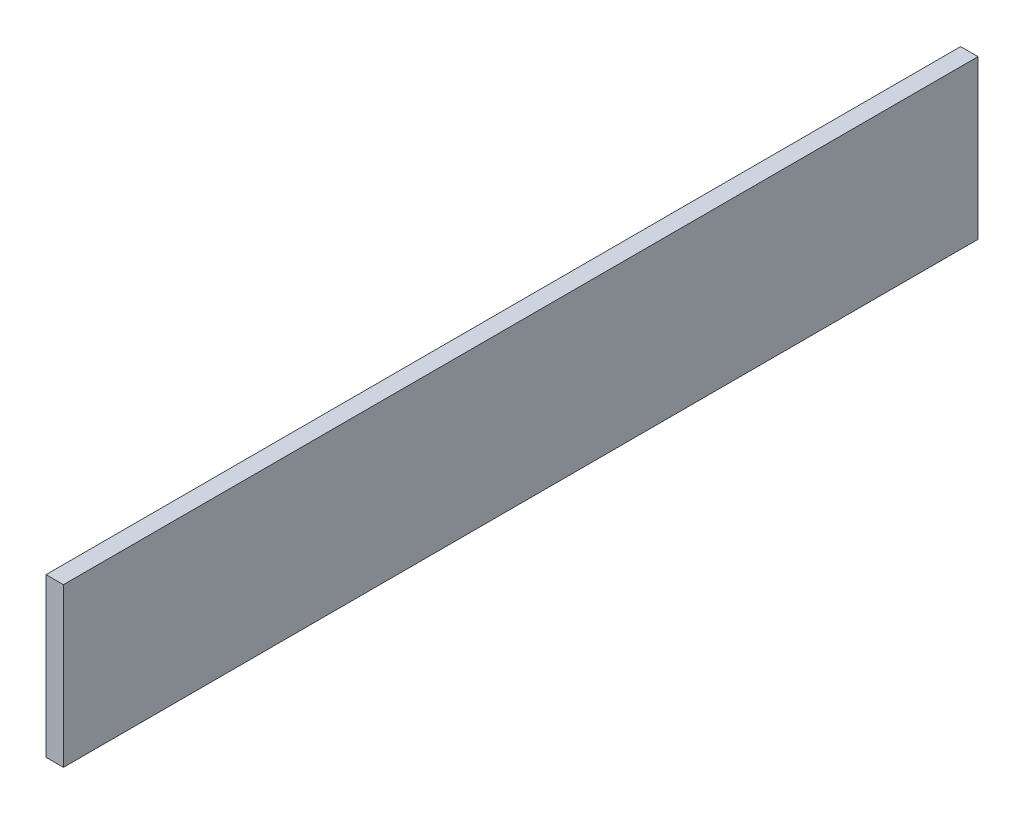
ISO-10303-21;
HEADER;
FILE_DESCRIPTION(('STEP AP214'),'2;1');
FILE_NAME('part.step','',(''),(''),'','','');
FILE_SCHEMA(('AUTOMOTIVE_DESIGN { 1 0 10303 214 1 1 1 1 }'));
ENDSEC;
DATA;
#1=APPLICATION_CONTEXT('core data for automotive mechanical design processes');
#2=APPLICATION_PROTOCOL_DEFINITION('international standard','automotive_design',2000,#1);
#3=PRODUCT_CONTEXT('',#1,'mechanical');
#4=PRODUCT('Part','Part','',(#3));
#5=PRODUCT_RELATED_PRODUCT_CATEGORY('part','',(#4));
#6=PRODUCT_DEFINITION_FORMATION('','',#4);
#7=PRODUCT_DEFINITION_CONTEXT('part definition',#1,'design');
#8=PRODUCT_DEFINITION('design','',#6,#7);
#9=PRODUCT_DEFINITION_SHAPE('','',#8);
#10=(LENGTH_UNIT() NAMED_UNIT(*) SI_UNIT(.MILLI.,.METRE.));
#11=(NAMED_UNIT(*) PLANE_ANGLE_UNIT() SI_UNIT($,.RADIAN.));
#12=(NAMED_UNIT(*) SI_UNIT($,.STERADIAN.) SOLID_ANGLE_UNIT());
#13=UNCERTAINTY_MEASURE_WITH_UNIT(LENGTH_MEASURE(1.E-05),#10,'distance_accuracy_value','');
#14=(GEOMETRIC_REPRESENTATION_CONTEXT(3) GLOBAL_UNCERTAINTY_ASSIGNED_CONTEXT((#13)) GLOBAL_UNIT_ASSIGNED_CONTEXT((#10,
#11,#12)) REPRESENTATION_CONTEXT('',''));
#15=CARTESIAN_POINT('',(0.,0.,0.));
#16=DIRECTION('',(0.,0.,1.));
#17=DIRECTION('',(1.,0.,0.));
#18=AXIS2_PLACEMENT_3D('',#15,#16,#17);
#19=CARTESIAN_POINT('',(22.,-100.,-578.));
#20=DIRECTION('',(0.,0.,1.));
#21=DIRECTION('',(1.,0.,0.));
#22=AXIS2_PLACEMENT_3D('',#19,#20,#21);
#23=PLANE('',#22);
#24=DIRECTION('',(0.,1.,0.));
#25=VECTOR('',#24,1.);
#26=CARTESIAN_POINT('',(0.,-100.,-578.));
#27=LINE('',#26,#25);
#28=CARTESIAN_POINT('',(0.,-100.,-578.));
#29=VERTEX_POINT('',#28);
#30=CARTESIAN_POINT('',(0.,100.,-578.));
#31=VERTEX_POINT('',#30);
#32=EDGE_CURVE('E96',#29,#31,#27,.T.);
#33=ORIENTED_EDGE('',*,*,#32,.T.);
#34=DIRECTION('',(-1.,0.,0.));
#35=VECTOR('',#34,1.);
#36=CARTESIAN_POINT('',(22.,100.,-578.));
#37=LINE('',#36,#35);
#38=CARTESIAN_POINT('',(22.,100.,-578.));
#39=VERTEX_POINT('',#38);
#40=EDGE_CURVE('E11',#39,#31,#37,.T.);
#41=ORIENTED_EDGE('',*,*,#40,.F.);
#42=DIRECTION('',(0.,1.,0.));
#43=VECTOR('',#42,1.);
#44=CARTESIAN_POINT('',(22.,-100.,-578.));
#45=LINE('',#44,#43);
#46=CARTESIAN_POINT('',(22.,-100.,-578.));
#47=VERTEX_POINT('',#46);
#48=EDGE_CURVE('E84',#47,#39,#45,.T.);
#49=ORIENTED_EDGE('',*,*,#48,.F.);
#50=DIRECTION('',(-1.,0.,0.));
#51=VECTOR('',#50,1.);
#52=CARTESIAN_POINT('',(22.,-100.,-578.));
#53=LINE('',#52,#51);
#54=EDGE_CURVE('E92',#47,#29,#53,.T.);
#55=ORIENTED_EDGE('',*,*,#54,.T.);
#56=EDGE_LOOP('',(#33,#41,#49,#55));
#57=FACE_BOUND('',#56,.T.);
#58=ADVANCED_FACE('F33',(#57),#23,.F.);
#59=CARTESIAN_POINT('',(22.,100.,578.));
#60=DIRECTION('',(0.,-1.,0.));
#61=DIRECTION('',(0.,0.,-1.));
#62=AXIS2_PLACEMENT_3D('',#59,#60,#61);
#63=PLANE('',#62);
#64=DIRECTION('',(0.,0.,1.));
#65=VECTOR('',#64,1.);
#66=CARTESIAN_POINT('',(0.,100.,578.));
#67=LINE('',#66,#65);
#68=CARTESIAN_POINT('',(0.,100.,578.));
#69=VERTEX_POINT('',#68);
#70=EDGE_CURVE('E88',#31,#69,#67,.T.);
#71=ORIENTED_EDGE('',*,*,#70,.T.);
#72=DIRECTION('',(-1.,0.,0.));
#73=VECTOR('',#72,1.);
#74=CARTESIAN_POINT('',(22.,100.,578.));
#75=LINE('',#74,#73);
#76=CARTESIAN_POINT('',(22.,100.,578.));
#77=VERTEX_POINT('',#76);
#78=EDGE_CURVE('E41',#77,#69,#75,.T.);
#79=ORIENTED_EDGE('',*,*,#78,.F.);
#80=DIRECTION('',(0.,0.,1.));
#81=VECTOR('',#80,1.);
#82=CARTESIAN_POINT('',(22.,100.,578.));
#83=LINE('',#82,#81);
#84=EDGE_CURVE('E79',#39,#77,#83,.T.);
#85=ORIENTED_EDGE('',*,*,#84,.F.);
#86=ORIENTED_EDGE('',*,*,#40,.T.);
#87=EDGE_LOOP('',(#71,#79,#85,#86));
#88=FACE_BOUND('',#87,.T.);
#89=ADVANCED_FACE('F87',(#88),#63,.F.);
#90=CARTESIAN_POINT('',(22.,-100.,578.));
#91=DIRECTION('',(0.,0.,-1.));
#92=DIRECTION('',(-1.,0.,0.));
#93=AXIS2_PLACEMENT_3D('',#90,#91,#92);
#94=PLANE('',#93);
#95=DIRECTION('',(0.,-1.,0.));
#96=VECTOR('',#95,1.);
#97=CARTESIAN_POINT('',(0.,-100.,578.));
#98=LINE('',#97,#96);
#99=CARTESIAN_POINT('',(0.,-100.,578.));
#100=VERTEX_POINT('',#99);
#101=EDGE_CURVE('E66',#69,#100,#98,.T.);
#102=ORIENTED_EDGE('',*,*,#101,.T.);
#103=DIRECTION('',(-1.,0.,0.));
#104=VECTOR('',#103,1.);
#105=CARTESIAN_POINT('',(22.,-100.,578.));
#106=LINE('',#105,#104);
#107=CARTESIAN_POINT('',(22.,-100.,578.));
#108=VERTEX_POINT('',#107);
#109=EDGE_CURVE('E89',#108,#100,#106,.T.);
#110=ORIENTED_EDGE('',*,*,#109,.F.);
#111=DIRECTION('',(0.,-1.,0.));
#112=VECTOR('',#111,1.);
#113=CARTESIAN_POINT('',(22.,-100.,578.));
#114=LINE('',#113,#112);
#115=EDGE_CURVE('E82',#77,#108,#114,.T.);
#116=ORIENTED_EDGE('',*,*,#115,.F.);
#117=ORIENTED_EDGE('',*,*,#78,.T.);
#118=EDGE_LOOP('',(#102,#110,#116,#117));
#119=FACE_BOUND('',#118,.T.);
#120=ADVANCED_FACE('F90',(#119),#94,.F.);
#121=CARTESIAN_POINT('',(22.,-100.,578.));
#122=DIRECTION('',(0.,1.,0.));
#123=DIRECTION('',(0.,0.,1.));
#124=AXIS2_PLACEMENT_3D('',#121,#122,#123);
#125=PLANE('',#124);
#126=DIRECTION('',(0.,0.,-1.));
#127=VECTOR('',#126,1.);
#128=CARTESIAN_POINT('',(0.,-100.,578.));
#129=LINE('',#128,#127);
#130=EDGE_CURVE('E72',#100,#29,#129,.T.);
#131=ORIENTED_EDGE('',*,*,#130,.T.);
#132=ORIENTED_EDGE('',*,*,#54,.F.);
#133=DIRECTION('',(0.,0.,-1.));
#134=VECTOR('',#133,1.);
#135=CARTESIAN_POINT('',(22.,-100.,578.));
#136=LINE('',#135,#134);
#137=EDGE_CURVE('E49',#108,#47,#136,.T.);
#138=ORIENTED_EDGE('',*,*,#137,.F.);
#139=ORIENTED_EDGE('',*,*,#109,.T.);
#140=EDGE_LOOP('',(#131,#132,#138,#139));
#141=FACE_BOUND('',#140,.T.);
#142=ADVANCED_FACE('F103',(#141),#125,.F.);
#143=CARTESIAN_POINT('',(22.,0.,0.));
#144=DIRECTION('',(-1.,0.,0.));
#145=DIRECTION('',(0.,0.,1.));
#146=AXIS2_PLACEMENT_3D('',#143,#144,#145);
#147=PLANE('',#146);
#148=ORIENTED_EDGE('',*,*,#48,.T.);
#149=ORIENTED_EDGE('',*,*,#84,.T.);
#150=ORIENTED_EDGE('',*,*,#115,.T.);
#151=ORIENTED_EDGE('',*,*,#137,.T.);
#152=EDGE_LOOP('',(#148,#149,#150,#151));
#153=FACE_BOUND('',#152,.T.);
#154=ADVANCED_FACE('F80',(#153),#147,.F.);
#155=CARTESIAN_POINT('',(0.,0.,0.));
#156=DIRECTION('',(-1.,0.,0.));
#157=DIRECTION('',(0.,0.,1.));
#158=AXIS2_PLACEMENT_3D('',#155,#156,#157);
#159=PLANE('',#158);
#160=ORIENTED_EDGE('',*,*,#32,.F.);
#161=ORIENTED_EDGE('',*,*,#130,.F.);
#162=ORIENTED_EDGE('',*,*,#101,.F.);
#163=ORIENTED_EDGE('',*,*,#70,.F.);
#164=EDGE_LOOP('',(#160,#161,#162,#163));
#165=FACE_BOUND('',#164,.T.);
#166=ADVANCED_FACE('F106',(#165),#159,.T.);
#167=CLOSED_SHELL('',(#58,#89,#120,#142,#154,#166));
#168=MANIFOLD_SOLID_BREP('B2',#167);
#169=ADVANCED_BREP_SHAPE_REPRESENTATION('',(#18,#168),#14);
#170=SHAPE_DEFINITION_REPRESENTATION(#9,#169);
ENDSEC;
END-ISO-10303-21;
